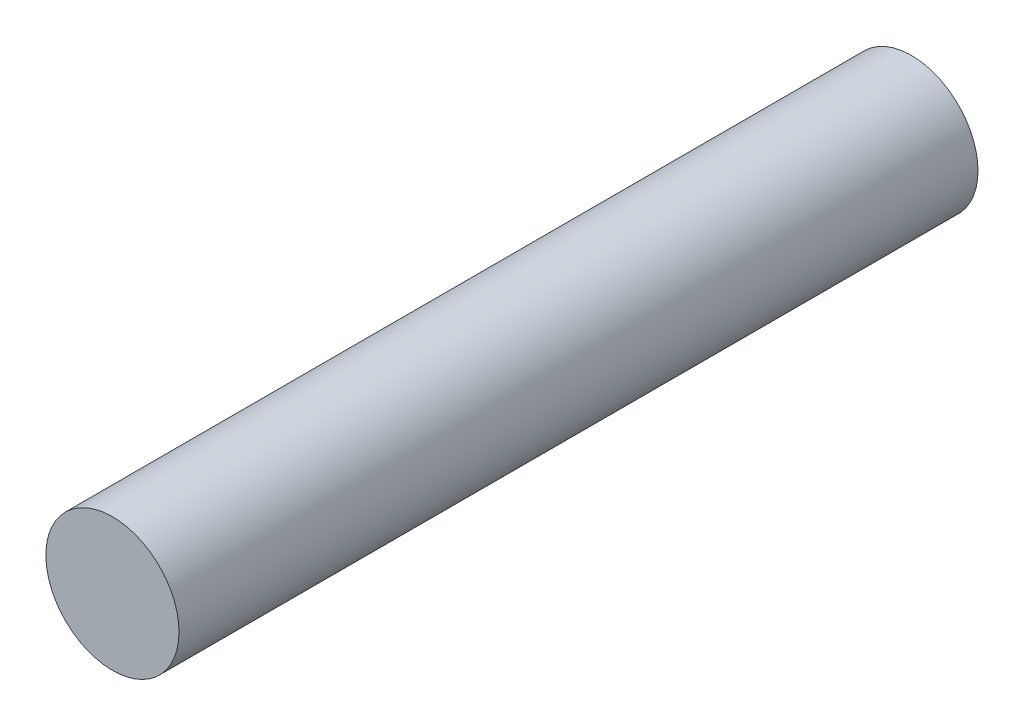
ISO-10303-21;
HEADER;
FILE_DESCRIPTION(('STEP AP214'),'2;1');
FILE_NAME('part.step','',(''),(''),'','','');
FILE_SCHEMA(('AUTOMOTIVE_DESIGN { 1 0 10303 214 1 1 1 1 }'));
ENDSEC;
DATA;
#1=APPLICATION_CONTEXT('core data for automotive mechanical design processes');
#2=APPLICATION_PROTOCOL_DEFINITION('international standard','automotive_design',2000,#1);
#3=PRODUCT_CONTEXT('',#1,'mechanical');
#4=PRODUCT('Part','Part','',(#3));
#5=PRODUCT_RELATED_PRODUCT_CATEGORY('part','',(#4));
#6=PRODUCT_DEFINITION_FORMATION('','',#4);
#7=PRODUCT_DEFINITION_CONTEXT('part definition',#1,'design');
#8=PRODUCT_DEFINITION('design','',#6,#7);
#9=PRODUCT_DEFINITION_SHAPE('','',#8);
#10=(LENGTH_UNIT() NAMED_UNIT(*) SI_UNIT(.MILLI.,.METRE.));
#11=(NAMED_UNIT(*) PLANE_ANGLE_UNIT() SI_UNIT($,.RADIAN.));
#12=(NAMED_UNIT(*) SI_UNIT($,.STERADIAN.) SOLID_ANGLE_UNIT());
#13=UNCERTAINTY_MEASURE_WITH_UNIT(LENGTH_MEASURE(1.E-05),#10,'distance_accuracy_value','');
#14=(GEOMETRIC_REPRESENTATION_CONTEXT(3) GLOBAL_UNCERTAINTY_ASSIGNED_CONTEXT((#13)) GLOBAL_UNIT_ASSIGNED_CONTEXT((#10,
#11,#12)) REPRESENTATION_CONTEXT('',''));
#15=CARTESIAN_POINT('',(0.,0.,0.));
#16=DIRECTION('',(0.,0.,1.));
#17=DIRECTION('',(1.,0.,0.));
#18=AXIS2_PLACEMENT_3D('',#15,#16,#17);
#19=CARTESIAN_POINT('',(0.,0.,76.2));
#20=DIRECTION('',(0.,0.,1.));
#21=DIRECTION('',(1.,0.,0.));
#22=AXIS2_PLACEMENT_3D('',#19,#20,#21);
#23=PLANE('',#22);
#24=CARTESIAN_POINT('',(0.,0.,76.2));
#25=DIRECTION('',(0.,0.,1.));
#26=DIRECTION('',(1.,0.,0.));
#27=AXIS2_PLACEMENT_3D('',#24,#25,#26);
#28=CIRCLE('',#27,6.35);
#29=CARTESIAN_POINT('',(6.35,0.,76.2));
#30=VERTEX_POINT('',#29);
#31=EDGE_CURVE('E18',#30,#30,#28,.F.);
#32=ORIENTED_EDGE('',*,*,#31,.F.);
#33=EDGE_LOOP('',(#32));
#34=FACE_BOUND('',#33,.T.);
#35=ADVANCED_FACE('F15',(#34),#23,.T.);
#36=CARTESIAN_POINT('',(0.,0.,0.));
#37=DIRECTION('',(0.,0.,1.));
#38=DIRECTION('',(1.,0.,0.));
#39=AXIS2_PLACEMENT_3D('',#36,#37,#38);
#40=PLANE('',#39);
#41=CARTESIAN_POINT('',(0.,0.,0.));
#42=DIRECTION('',(0.,0.,1.));
#43=DIRECTION('',(1.,0.,0.));
#44=AXIS2_PLACEMENT_3D('',#41,#42,#43);
#45=CIRCLE('',#44,6.35);
#46=CARTESIAN_POINT('',(6.35,0.,0.));
#47=VERTEX_POINT('',#46);
#48=EDGE_CURVE('E10',#47,#47,#45,.T.);
#49=ORIENTED_EDGE('',*,*,#48,.F.);
#50=EDGE_LOOP('',(#49));
#51=FACE_BOUND('',#50,.T.);
#52=ADVANCED_FACE('F30',(#51),#40,.F.);
#53=CARTESIAN_POINT('',(0.,0.,0.));
#54=DIRECTION('',(0.,0.,1.));
#55=DIRECTION('',(1.,0.,0.));
#56=AXIS2_PLACEMENT_3D('',#53,#54,#55);
#57=CYLINDRICAL_SURFACE('',#56,6.35);
#58=ORIENTED_EDGE('',*,*,#31,.T.);
#59=EDGE_LOOP('',(#58));
#60=FACE_BOUND('',#59,.T.);
#61=ORIENTED_EDGE('',*,*,#48,.T.);
#62=EDGE_LOOP('',(#61));
#63=FACE_BOUND('',#62,.T.);
#64=ADVANCED_FACE('F27',(#60,#63),#57,.T.);
#65=CLOSED_SHELL('',(#35,#52,#64));
#66=MANIFOLD_SOLID_BREP('B1',#65);
#67=ADVANCED_BREP_SHAPE_REPRESENTATION('',(#18,#66),#14);
#68=SHAPE_DEFINITION_REPRESENTATION(#9,#67);
ENDSEC;
END-ISO-10303-21;
